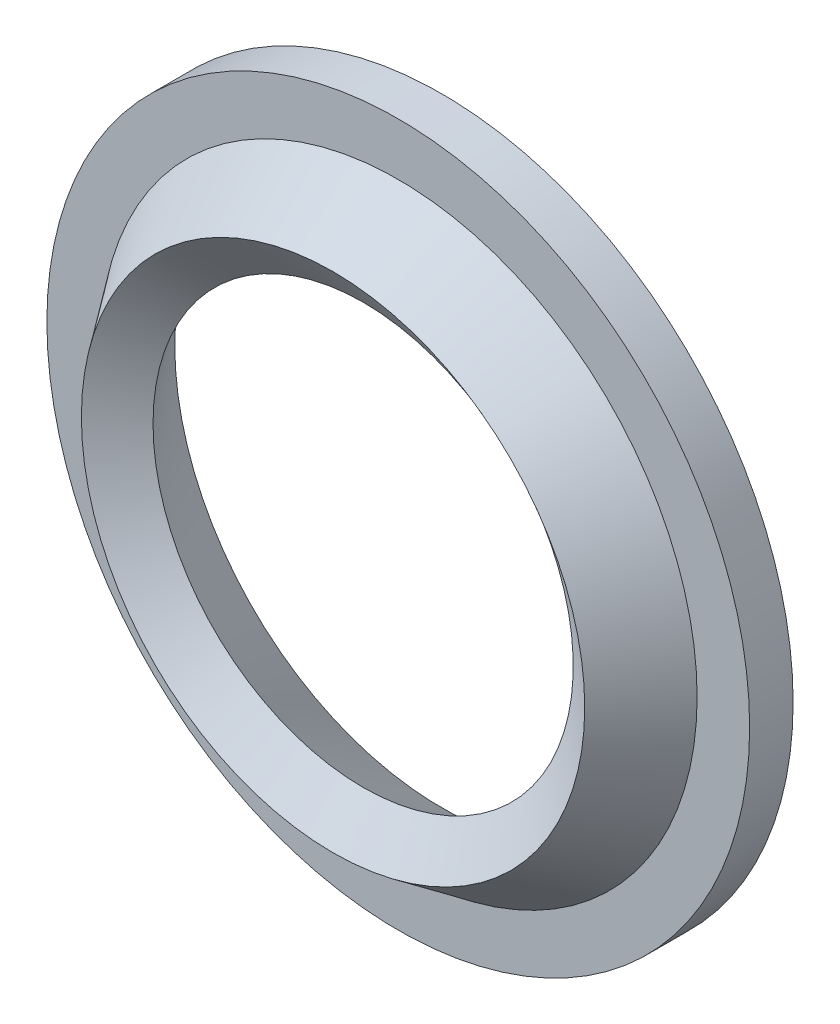
ISO-10303-21;
HEADER;
FILE_DESCRIPTION(('STEP AP214'),'2;1');
FILE_NAME('part.step','',(''),(''),'','','');
FILE_SCHEMA(('AUTOMOTIVE_DESIGN { 1 0 10303 214 1 1 1 1 }'));
ENDSEC;
DATA;
#1=APPLICATION_CONTEXT('core data for automotive mechanical design processes');
#2=APPLICATION_PROTOCOL_DEFINITION('international standard','automotive_design',2000,#1);
#3=PRODUCT_CONTEXT('',#1,'mechanical');
#4=PRODUCT('Part','Part','',(#3));
#5=PRODUCT_RELATED_PRODUCT_CATEGORY('part','',(#4));
#6=PRODUCT_DEFINITION_FORMATION('','',#4);
#7=PRODUCT_DEFINITION_CONTEXT('part definition',#1,'design');
#8=PRODUCT_DEFINITION('design','',#6,#7);
#9=PRODUCT_DEFINITION_SHAPE('','',#8);
#10=(LENGTH_UNIT() NAMED_UNIT(*) SI_UNIT(.MILLI.,.METRE.));
#11=(NAMED_UNIT(*) PLANE_ANGLE_UNIT() SI_UNIT($,.RADIAN.));
#12=(NAMED_UNIT(*) SI_UNIT($,.STERADIAN.) SOLID_ANGLE_UNIT());
#13=UNCERTAINTY_MEASURE_WITH_UNIT(LENGTH_MEASURE(1.E-05),#10,'distance_accuracy_value','');
#14=(GEOMETRIC_REPRESENTATION_CONTEXT(3) GLOBAL_UNCERTAINTY_ASSIGNED_CONTEXT((#13)) GLOBAL_UNIT_ASSIGNED_CONTEXT((#10,
#11,#12)) REPRESENTATION_CONTEXT('',''));
#15=CARTESIAN_POINT('',(0.,0.,0.));
#16=DIRECTION('',(0.,0.,1.));
#17=DIRECTION('',(1.,0.,0.));
#18=AXIS2_PLACEMENT_3D('',#15,#16,#17);
#19=CARTESIAN_POINT('',(0.,0.,0.304799999980787));
#20=DIRECTION('',(0.,0.,-1.));
#21=DIRECTION('',(-1.,0.,0.));
#22=AXIS2_PLACEMENT_3D('',#19,#20,#21);
#23=CONICAL_SURFACE('',#22,2.09549999999581,0.626400850485195);
#24=CARTESIAN_POINT('',(0.,0.,0.762000000008811));
#25=DIRECTION('',(0.,0.,1.));
#26=DIRECTION('',(0.,1.,0.));
#27=AXIS2_PLACEMENT_3D('',#24,#25,#26);
#28=CIRCLE('',#27,1.76466246938389);
#29=CARTESIAN_POINT('',(0.,1.76466246938389,0.762000000008811));
#30=VERTEX_POINT('',#29);
#31=EDGE_CURVE('E29',#30,#30,#28,.F.);
#32=ORIENTED_EDGE('',*,*,#31,.T.);
#33=EDGE_LOOP('',(#32));
#34=FACE_BOUND('',#33,.T.);
#35=CARTESIAN_POINT('',(0.,0.,0.304799999980787));
#36=DIRECTION('',(0.,0.,-1.));
#37=DIRECTION('',(-1.,0.,0.));
#38=AXIS2_PLACEMENT_3D('',#35,#36,#37);
#39=CIRCLE('',#38,2.09549999999581);
#40=CARTESIAN_POINT('',(-2.09549999999581,0.,0.304799999980787));
#41=VERTEX_POINT('',#40);
#42=EDGE_CURVE('E17',#41,#41,#39,.F.);
#43=ORIENTED_EDGE('',*,*,#42,.T.);
#44=EDGE_LOOP('',(#43));
#45=FACE_BOUND('',#44,.T.);
#46=ADVANCED_FACE('F14',(#34,#45),#23,.T.);
#47=CARTESIAN_POINT('',(0.,0.,0.3048));
#48=DIRECTION('',(0.,0.,-1.));
#49=DIRECTION('',(-1.,0.,0.));
#50=AXIS2_PLACEMENT_3D('',#47,#48,#49);
#51=PLANE('',#50);
#52=ORIENTED_EDGE('',*,*,#42,.F.);
#53=EDGE_LOOP('',(#52));
#54=FACE_BOUND('',#53,.T.);
#55=CARTESIAN_POINT('',(0.,0.,0.3048));
#56=DIRECTION('',(0.,0.,-1.));
#57=DIRECTION('',(-1.,0.,0.));
#58=AXIS2_PLACEMENT_3D('',#55,#56,#57);
#59=CIRCLE('',#58,2.4638);
#60=CARTESIAN_POINT('',(-2.4638,0.,0.3048));
#61=VERTEX_POINT('',#60);
#62=EDGE_CURVE('E31',#61,#61,#59,.T.);
#63=ORIENTED_EDGE('',*,*,#62,.F.);
#64=EDGE_LOOP('',(#63));
#65=FACE_BOUND('',#64,.T.);
#66=ADVANCED_FACE('F43',(#54,#65),#51,.F.);
#67=CARTESIAN_POINT('',(0.,0.,0.761999999951968));
#68=DIRECTION('',(0.,0.,1.));
#69=DIRECTION('',(1.,0.,0.));
#70=AXIS2_PLACEMENT_3D('',#67,#68,#69);
#71=CONICAL_SURFACE('',#70,1.76466246927021,0.944395476355029);
#72=CARTESIAN_POINT('',(0.,0.,0.551092905425321));
#73=DIRECTION('',(0.,0.,-1.));
#74=DIRECTION('',(0.,-1.,0.));
#75=AXIS2_PLACEMENT_3D('',#72,#73,#74);
#76=CIRCLE('',#75,1.47319999996398);
#77=CARTESIAN_POINT('',(0.,-1.47319999996398,0.551092905425321));
#78=VERTEX_POINT('',#77);
#79=EDGE_CURVE('E26',#78,#78,#76,.T.);
#80=ORIENTED_EDGE('',*,*,#79,.T.);
#81=EDGE_LOOP('',(#80));
#82=FACE_BOUND('',#81,.T.);
#83=ORIENTED_EDGE('',*,*,#31,.F.);
#84=EDGE_LOOP('',(#83));
#85=FACE_BOUND('',#84,.T.);
#86=ADVANCED_FACE('F46',(#82,#85),#71,.F.);
#87=CARTESIAN_POINT('',(0.,0.,0.8001));
#88=DIRECTION('',(0.,0.,-1.));
#89=DIRECTION('',(-1.,0.,0.));
#90=AXIS2_PLACEMENT_3D('',#87,#88,#89);
#91=CYLINDRICAL_SURFACE('',#90,2.4638);
#92=CARTESIAN_POINT('',(0.,0.,0.));
#93=DIRECTION('',(0.,0.,-1.));
#94=DIRECTION('',(-1.,0.,0.));
#95=AXIS2_PLACEMENT_3D('',#92,#93,#94);
#96=CIRCLE('',#95,2.4638);
#97=CARTESIAN_POINT('',(-2.4638,0.,0.));
#98=VERTEX_POINT('',#97);
#99=EDGE_CURVE('E21',#98,#98,#96,.T.);
#100=ORIENTED_EDGE('',*,*,#99,.F.);
#101=EDGE_LOOP('',(#100));
#102=FACE_BOUND('',#101,.T.);
#103=ORIENTED_EDGE('',*,*,#62,.T.);
#104=EDGE_LOOP('',(#103));
#105=FACE_BOUND('',#104,.T.);
#106=ADVANCED_FACE('F52',(#102,#105),#91,.T.);
#107=CARTESIAN_POINT('',(0.,0.,0.));
#108=DIRECTION('',(0.,0.,-1.));
#109=DIRECTION('',(-1.,0.,0.));
#110=AXIS2_PLACEMENT_3D('',#107,#108,#109);
#111=CONICAL_SURFACE('',#110,1.87197999991895,0.626400850401665);
#112=CARTESIAN_POINT('',(0.,0.,0.));
#113=DIRECTION('',(0.,0.,-1.));
#114=DIRECTION('',(-1.,0.,0.));
#115=AXIS2_PLACEMENT_3D('',#112,#113,#114);
#116=CIRCLE('',#115,1.87197999991895);
#117=CARTESIAN_POINT('',(-1.87197999991895,0.,0.));
#118=VERTEX_POINT('',#117);
#119=EDGE_CURVE('E10',#118,#118,#116,.F.);
#120=ORIENTED_EDGE('',*,*,#119,.F.);
#121=EDGE_LOOP('',(#120));
#122=FACE_BOUND('',#121,.T.);
#123=ORIENTED_EDGE('',*,*,#79,.F.);
#124=EDGE_LOOP('',(#123));
#125=FACE_BOUND('',#124,.T.);
#126=ADVANCED_FACE('F57',(#122,#125),#111,.F.);
#127=CARTESIAN_POINT('',(0.,0.,0.));
#128=DIRECTION('',(0.,0.,-1.));
#129=DIRECTION('',(-1.,0.,0.));
#130=AXIS2_PLACEMENT_3D('',#127,#128,#129);
#131=PLANE('',#130);
#132=ORIENTED_EDGE('',*,*,#119,.T.);
#133=EDGE_LOOP('',(#132));
#134=FACE_BOUND('',#133,.T.);
#135=ORIENTED_EDGE('',*,*,#99,.T.);
#136=EDGE_LOOP('',(#135));
#137=FACE_BOUND('',#136,.T.);
#138=ADVANCED_FACE('F55',(#134,#137),#131,.T.);
#139=CLOSED_SHELL('',(#46,#66,#86,#106,#126,#138));
#140=MANIFOLD_SOLID_BREP('B1',#139);
#141=ADVANCED_BREP_SHAPE_REPRESENTATION('',(#18,#140),#14);
#142=SHAPE_DEFINITION_REPRESENTATION(#9,#141);
ENDSEC;
END-ISO-10303-21;
